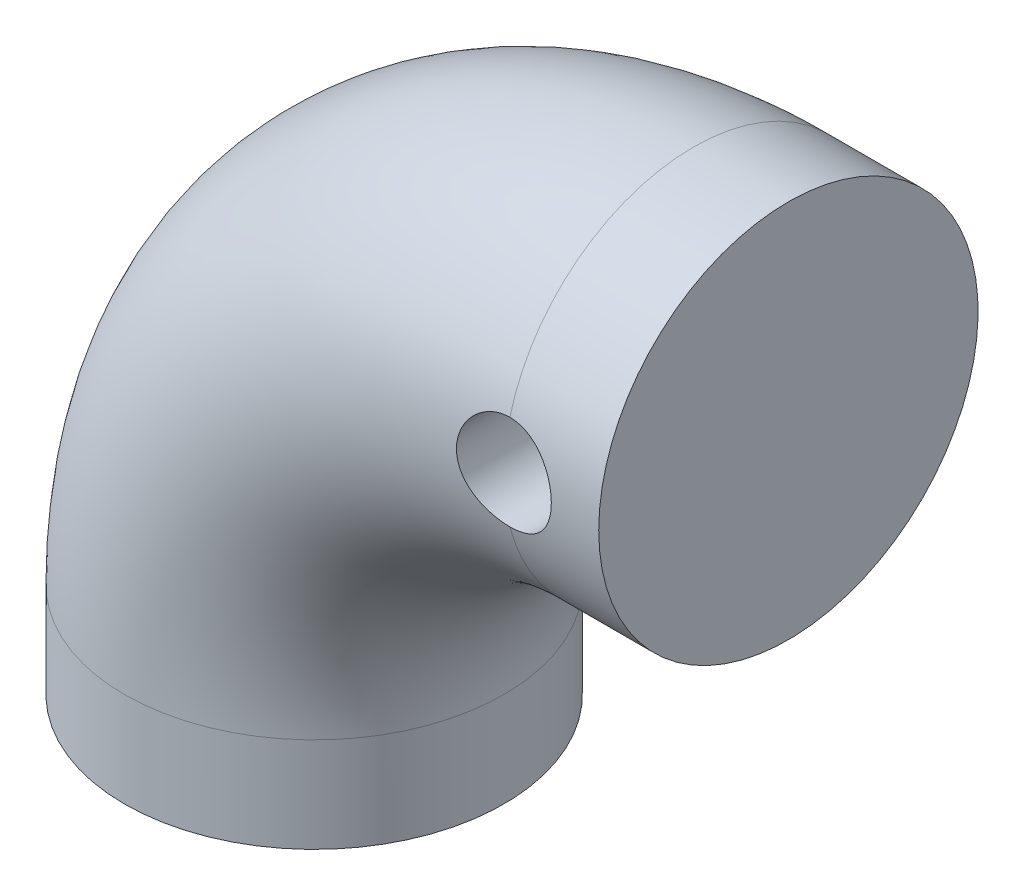
ISO-10303-21;
HEADER;
FILE_DESCRIPTION(('STEP AP214'),'2;1');
FILE_NAME('part.step','',(''),(''),'','','');
FILE_SCHEMA(('AUTOMOTIVE_DESIGN { 1 0 10303 214 1 1 1 1 }'));
ENDSEC;
DATA;
#1=APPLICATION_CONTEXT('core data for automotive mechanical design processes');
#2=APPLICATION_PROTOCOL_DEFINITION('international standard','automotive_design',2000,#1);
#3=PRODUCT_CONTEXT('',#1,'mechanical');
#4=PRODUCT('Part','Part','',(#3));
#5=PRODUCT_RELATED_PRODUCT_CATEGORY('part','',(#4));
#6=PRODUCT_DEFINITION_FORMATION('','',#4);
#7=PRODUCT_DEFINITION_CONTEXT('part definition',#1,'design');
#8=PRODUCT_DEFINITION('design','',#6,#7);
#9=PRODUCT_DEFINITION_SHAPE('','',#8);
#10=(LENGTH_UNIT() NAMED_UNIT(*) SI_UNIT(.MILLI.,.METRE.));
#11=(NAMED_UNIT(*) PLANE_ANGLE_UNIT() SI_UNIT($,.RADIAN.));
#12=(NAMED_UNIT(*) SI_UNIT($,.STERADIAN.) SOLID_ANGLE_UNIT());
#13=UNCERTAINTY_MEASURE_WITH_UNIT(LENGTH_MEASURE(1.E-05),#10,'distance_accuracy_value','');
#14=(GEOMETRIC_REPRESENTATION_CONTEXT(3) GLOBAL_UNCERTAINTY_ASSIGNED_CONTEXT((#13)) GLOBAL_UNIT_ASSIGNED_CONTEXT((#10,
#11,#12)) REPRESENTATION_CONTEXT('',''));
#15=CARTESIAN_POINT('',(0.,0.,0.));
#16=DIRECTION('',(0.,0.,1.));
#17=DIRECTION('',(1.,0.,0.));
#18=AXIS2_PLACEMENT_3D('',#15,#16,#17);
#19=CARTESIAN_POINT('',(-16.2646274369759,-3.10070951315685,0.));
#20=DIRECTION('',(0.,0.,-1.));
#21=DIRECTION('',(-1.,0.,0.));
#22=AXIS2_PLACEMENT_3D('',#19,#20,#21);
#23=TOROIDAL_SURFACE('',#22,16.,8.);
#24=CARTESIAN_POINT('',(-32.2646274369759,-3.10070951315696,0.));
#25=DIRECTION('',(0.,-1.,0.));
#26=DIRECTION('',(0.,0.,1.));
#27=AXIS2_PLACEMENT_3D('',#24,#25,#26);
#28=CIRCLE('',#27,8.);
#29=CARTESIAN_POINT('',(-32.2646274369759,-3.10070951315696,8.));
#30=VERTEX_POINT('',#29);
#31=EDGE_CURVE('E97',#30,#30,#28,.T.);
#32=ORIENTED_EDGE('',*,*,#31,.F.);
#33=EDGE_LOOP('',(#32));
#34=FACE_BOUND('',#33,.T.);
#35=CARTESIAN_POINT('',(-16.2644274369758,14.8992904768431,7.74596669470996));
#36=CARTESIAN_POINT('',(-16.3198963583289,14.8992964723466,7.74596279627583));
#37=CARTESIAN_POINT('',(-16.3753382984734,14.8969924919484,7.74649438566107));
#38=CARTESIAN_POINT('',(-16.4858127997248,14.8877953122605,7.74860003495758));
#39=CARTESIAN_POINT('',(-16.5408454152281,14.8809027341945,7.75017395375374));
#40=CARTESIAN_POINT('',(-16.7045367343919,14.8534345933593,7.75640593820359));
#41=CARTESIAN_POINT('',(-16.8120787800827,14.826068280207,7.76257451874861));
#42=CARTESIAN_POINT('',(-17.0208926696999,14.7540894931804,7.77832450177818));
#43=CARTESIAN_POINT('',(-17.1221641800592,14.7094761027439,7.78790608563796));
#44=CARTESIAN_POINT('',(-17.3158064810296,14.6043294786688,7.80953706738943));
#45=CARTESIAN_POINT('',(-17.4081759238434,14.5437938395163,7.82158683811086));
#46=CARTESIAN_POINT('',(-17.5829334771972,14.4074487383881,7.84718534474704));
#47=CARTESIAN_POINT('',(-17.6651474576771,14.3314199747597,7.86075417581855));
#48=CARTESIAN_POINT('',(-17.8157811081059,14.1667206699925,7.88789939611935));
#49=CARTESIAN_POINT('',(-17.8841980594522,14.0780476432596,7.90147578631069));
#50=CARTESIAN_POINT('',(-18.0062475158491,13.8890350230196,7.92745742215485));
#51=CARTESIAN_POINT('',(-18.0596528344673,13.7885457619202,7.93984297847902));
#52=CARTESIAN_POINT('',(-18.1487447938019,13.5797194457545,7.96187522549915));
#53=CARTESIAN_POINT('',(-18.1844339521441,13.4713835082805,7.97152230527379));
#54=CARTESIAN_POINT('',(-18.2365722074219,13.2514671064246,7.98684495090928));
#55=CARTESIAN_POINT('',(-18.2532772238909,13.1399510956969,7.9925729187712));
#56=CARTESIAN_POINT('',(-18.2677173302451,12.9155624123354,7.99951923763378));
#57=CARTESIAN_POINT('',(-18.2654554837306,12.8026899617399,8.00073831688153));
#58=CARTESIAN_POINT('',(-18.2423011018798,12.5817273410697,7.99841536806152));
#59=CARTESIAN_POINT('',(-18.2218657533927,12.4735877320668,7.99498909916222));
#60=CARTESIAN_POINT('',(-18.1636489347316,12.2623266684941,7.98381714042157));
#61=CARTESIAN_POINT('',(-18.1258677117286,12.1592051424421,7.9760715121288));
#62=CARTESIAN_POINT('',(-18.0341370484662,11.9607885489642,7.95699481035872));
#63=CARTESIAN_POINT('',(-17.9801861026823,11.8654942113623,7.94566340301255));
#64=CARTESIAN_POINT('',(-17.8576729982234,11.685168153712,7.92058297592865));
#65=CARTESIAN_POINT('',(-17.789108402013,11.6001381494499,7.90683355293649));
#66=CARTESIAN_POINT('',(-17.6370889835886,11.4402308646258,7.87801502546714));
#67=CARTESIAN_POINT('',(-17.5532738766024,11.365700639622,7.86291989376912));
#68=CARTESIAN_POINT('',(-17.3742515932088,11.2315840108773,7.83357733225181));
#69=CARTESIAN_POINT('',(-17.2790405084275,11.1720027558637,7.8193301957844));
#70=CARTESIAN_POINT('',(-17.0783970949371,11.0688050105066,7.79337134487405));
#71=CARTESIAN_POINT('',(-16.9728472387335,11.0254078115884,7.78169527750584));
#72=CARTESIAN_POINT('',(-16.7556159961858,10.9571674708855,7.76282386679749));
#73=CARTESIAN_POINT('',(-16.6439448567049,10.9322942808147,7.75562127008746));
#74=CARTESIAN_POINT('',(-16.4868166624185,10.9111678343956,7.74945955391702));
#75=CARTESIAN_POINT('',(-16.4424319377579,10.9067095538232,7.74815131197833));
#76=CARTESIAN_POINT('',(-16.3535143592249,10.9007718590859,7.74640441710349));
#77=CARTESIAN_POINT('',(-16.3089818324647,10.8992879335329,7.74596444722109));
#78=CARTESIAN_POINT('',(-16.2644274369758,10.8992904968431,7.74596669536566));
#79=B_SPLINE_CURVE_WITH_KNOTS('',3,(#35,#36,#37,#38,#39,#40,#41,#42,#43,#44,#45,#46,#47,#48,#49,
#50,#51,#52,#53,#54,#55,#56,#57,#58,#59,#60,#61,#62,#63,#64,#65,#66,#67,#68,#69,#70,#71,#72,#73,
#74,#75,#76,#77,#78),.UNSPECIFIED.,.F.,.F.,(4,2,2,2,2,2,2,2,2,2,2,2,2,2,2,2,2,2,2,2,2,4),(0.,
0.166302443747068,0.33258237734283,0.664283916643011,0.996003085993996,1.32777239988591,
1.66461241936267,2.00151874596241,2.34327860411946,2.68498988121184,3.02203787715162,
3.35903143286017,3.68777984335217,4.01652356947294,4.3452979136556,4.67412713988857,
5.01207781837567,5.35014473461499,5.69263894376778,6.03457636659706,6.16837189951974,
6.30196434245598),.UNSPECIFIED.);
#80=CARTESIAN_POINT('',(-16.2646274369758,14.8992904868431,7.74596669241486));
#81=VERTEX_POINT('',#80);
#82=CARTESIAN_POINT('',(-16.2646274369758,10.8992904868431,7.74596669241483));
#83=VERTEX_POINT('',#82);
#84=EDGE_CURVE('E66',#81,#83,#79,.T.);
#85=ORIENTED_EDGE('',*,*,#84,.F.);
#86=CARTESIAN_POINT('',(-16.2646274369758,12.8992904868431,0.));
#87=DIRECTION('',(-1.,0.,0.));
#88=DIRECTION('',(0.,0.,1.));
#89=AXIS2_PLACEMENT_3D('',#86,#87,#88);
#90=CIRCLE('',#89,8.);
#91=CARTESIAN_POINT('',(-16.2646274369758,14.8992904868431,-7.74596669241483));
#92=VERTEX_POINT('',#91);
#93=EDGE_CURVE('E91',#81,#92,#90,.T.);
#94=ORIENTED_EDGE('',*,*,#93,.T.);
#95=CARTESIAN_POINT('',(-16.2644274369758,10.8992904968431,-7.74596669536566));
#96=CARTESIAN_POINT('',(-16.319578113701,10.8992839703992,-7.74595953911321));
#97=CARTESIAN_POINT('',(-16.3747012733496,10.9015621065643,-7.74663752576368));
#98=CARTESIAN_POINT('',(-16.4845282614433,10.9106525113388,-7.74930946569253));
#99=CARTESIAN_POINT('',(-16.5392321801846,10.9174637741605,-7.75130312705468));
#100=CARTESIAN_POINT('',(-16.7018544286906,10.9445874319759,-7.75915968096074));
#101=CARTESIAN_POINT('',(-16.8086442787464,10.9715901964583,-7.76689882349837));
#102=CARTESIAN_POINT('',(-17.0159375902487,11.0425320361574,-7.78629756811106));
#103=CARTESIAN_POINT('',(-17.1164430871611,11.0864655942142,-7.79795589290235));
#104=CARTESIAN_POINT('',(-17.3087572654123,11.1899866565218,-7.82365486887605));
#105=CARTESIAN_POINT('',(-17.4005621704172,11.2495809160612,-7.83769654719705));
#106=CARTESIAN_POINT('',(-17.5754215220392,11.3845844525672,-7.86680973435804));
#107=CARTESIAN_POINT('',(-17.6581879191825,11.4603632008417,-7.88189849267698));
#108=CARTESIAN_POINT('',(-17.8100069239361,11.6248007651052,-7.91094747069053));
#109=CARTESIAN_POINT('',(-17.8790585029829,11.713460546264,-7.92490760569581));
#110=CARTESIAN_POINT('',(-18.002192891992,11.9024338201155,-7.95024625386565));
#111=CARTESIAN_POINT('',(-18.0560983817019,12.002867302591,-7.96159392501181));
#112=CARTESIAN_POINT('',(-18.1461698733257,12.2117399638384,-7.98024496419699));
#113=CARTESIAN_POINT('',(-18.1823398479333,12.3201773434981,-7.9875492379903));
#114=CARTESIAN_POINT('',(-18.2350088758717,12.5388636269934,-7.99725647481948));
#115=CARTESIAN_POINT('',(-18.2520078838229,12.6489866335872,-7.99978522953584));
#116=CARTESIAN_POINT('',(-18.2675005578892,12.8705307894986,-8.00018834987486));
#117=CARTESIAN_POINT('',(-18.2659954933725,12.9819518492467,-7.99806303477212));
#118=CARTESIAN_POINT('',(-18.2447467605998,13.2010265465754,-7.98959873496608));
#119=CARTESIAN_POINT('',(-18.2253003107813,13.308711986125,-7.98332888751962));
#120=CARTESIAN_POINT('',(-18.1692335794895,13.5192465307459,-7.9673932226797));
#121=CARTESIAN_POINT('',(-18.1326119975964,13.6220952689561,-7.95772714815388));
#122=CARTESIAN_POINT('',(-18.0425562568654,13.8218788928146,-7.93584769122555));
#123=CARTESIAN_POINT('',(-17.9888594097957,13.9186910206197,-7.92359558842866));
#124=CARTESIAN_POINT('',(-17.8663529569518,14.1020525836862,-7.89788947770747));
#125=CARTESIAN_POINT('',(-17.7975414578262,14.1886007311267,-7.8844353193319));
#126=CARTESIAN_POINT('',(-17.6448416459411,14.3510914172027,-7.85732574777589));
#127=CARTESIAN_POINT('',(-17.560638909244,14.4267392529026,-7.84367296713201));
#128=CARTESIAN_POINT('',(-17.3805180391109,14.5628804830593,-7.81785882118256));
#129=CARTESIAN_POINT('',(-17.2845971850002,14.6233703482024,-7.80569780354823));
#130=CARTESIAN_POINT('',(-17.0836618661955,14.7274020110749,-7.78410646907138));
#131=CARTESIAN_POINT('',(-16.9786453247286,14.7709399257135,-7.77467677800546));
#132=CARTESIAN_POINT('',(-16.7625785151962,14.8396131518873,-7.75954803951872));
#133=CARTESIAN_POINT('',(-16.6515369585623,14.8647743103659,-7.75384375350868));
#134=CARTESIAN_POINT('',(-16.493687502749,14.8866650309772,-7.74885792633735));
#135=CARTESIAN_POINT('',(-16.4479309436778,14.8914046199685,-7.74777409247876));
#136=CARTESIAN_POINT('',(-16.3562658778957,14.8977160349445,-7.74632835230053));
#137=CARTESIAN_POINT('',(-16.3103577564481,14.8992931781335,-7.74596523420998));
#138=CARTESIAN_POINT('',(-16.2644274369758,14.8992904768431,-7.74596669470996));
#139=B_SPLINE_CURVE_WITH_KNOTS('',3,(#95,#96,#97,#98,#99,#100,#101,#102,#103,#104,#105,#106,
#107,#108,#109,#110,#111,#112,#113,#114,#115,#116,#117,#118,#119,#120,#121,#122,#123,#124,#125,
#126,#127,#128,#129,#130,#131,#132,#133,#134,#135,#136,#137,#138),.UNSPECIFIED.,.F.,.F.,(4,2,2,
2,2,2,2,2,2,2,2,2,2,2,2,2,2,2,2,2,2,4),(0.,0.165346212522924,0.330655751070991,
0.660206030721513,0.989649012018963,1.31923433342112,1.65735174023975,1.99549449511807,
2.3374450858854,2.67931904587686,3.01205482892804,3.34476778663333,3.67206608644251,
3.99938917173385,4.33201353893958,4.66467959643961,5.00511054395508,5.3456206823887,
5.6862087738001,6.02631690000448,6.16426685014104,6.30198466185553),.UNSPECIFIED.);
#140=CARTESIAN_POINT('',(-16.2646274369758,10.8992904868431,-7.74596669241481));
#141=VERTEX_POINT('',#140);
#142=EDGE_CURVE('E72',#141,#92,#139,.T.);
#143=ORIENTED_EDGE('',*,*,#142,.F.);
#144=EDGE_CURVE('E92',#141,#83,#90,.T.);
#145=ORIENTED_EDGE('',*,*,#144,.T.);
#146=EDGE_LOOP('',(#85,#94,#143,#145));
#147=FACE_BOUND('',#146,.T.);
#148=ADVANCED_FACE('F47',(#34,#147),#23,.T.);
#149=CARTESIAN_POINT('',(-16.2646274369758,12.8992904868432,0.));
#150=DIRECTION('',(1.,0.,0.));
#151=DIRECTION('',(0.,0.,-1.));
#152=AXIS2_PLACEMENT_3D('',#149,#150,#151);
#153=CYLINDRICAL_SURFACE('',#152,8.);
#154=CARTESIAN_POINT('',(-12.2646274369759,12.8992904868432,0.));
#155=DIRECTION('',(-1.,0.,0.));
#156=DIRECTION('',(0.,0.,1.));
#157=AXIS2_PLACEMENT_3D('',#154,#155,#156);
#158=CIRCLE('',#157,8.);
#159=CARTESIAN_POINT('',(-12.2646274369759,12.8992904868432,8.));
#160=VERTEX_POINT('',#159);
#161=EDGE_CURVE('E88',#160,#160,#158,.T.);
#162=ORIENTED_EDGE('',*,*,#161,.T.);
#163=EDGE_LOOP('',(#162));
#164=FACE_BOUND('',#163,.T.);
#165=CARTESIAN_POINT('',(-16.2646274369758,14.8992904868431,-7.74596669241486));
#166=CARTESIAN_POINT('',(-16.2093014667628,14.8992911618353,-7.74596297160357));
#167=CARTESIAN_POINT('',(-16.1540029109394,14.8969933015938,-7.74656019898944));
#168=CARTESIAN_POINT('',(-16.0438193663687,14.8878330776346,-7.7489180954912));
#169=CARTESIAN_POINT('',(-15.9889343096017,14.8809714819884,-7.75067856883376));
#170=CARTESIAN_POINT('',(-15.8257210905581,14.8536409656081,-7.7576342194411));
#171=CARTESIAN_POINT('',(-15.7185145000114,14.8264258771881,-7.7645040629762));
#172=CARTESIAN_POINT('',(-15.5103780894119,14.7548866393391,-7.78190845176008));
#173=CARTESIAN_POINT('',(-15.4094476805501,14.7105640976907,-7.79244265261862));
#174=CARTESIAN_POINT('',(-15.2164045396812,14.6061212428948,-7.8159826894388));
#175=CARTESIAN_POINT('',(-15.1242941811939,14.5459966935569,-7.82898918791296));
#176=CARTESIAN_POINT('',(-14.9495396731636,14.4102594304992,-7.85632524796052));
#177=CARTESIAN_POINT('',(-14.8671176644848,14.334365024411,-7.87067582057833));
#178=CARTESIAN_POINT('',(-14.7160232580104,14.1698420478755,-7.89890208792388));
#179=CARTESIAN_POINT('',(-14.64735305804,14.0812114458007,-7.91277770645076));
#180=CARTESIAN_POINT('',(-14.5248054337385,13.8922042856464,-7.93872364566498));
#181=CARTESIAN_POINT('',(-14.4711476450079,13.791681167512,-7.95076609363462));
#182=CARTESIAN_POINT('',(-14.3815779685824,13.5826956685289,-7.97144692501178));
#183=CARTESIAN_POINT('',(-14.3456625883762,13.4742348550091,-7.98008597829402));
#184=CARTESIAN_POINT('',(-14.293309451421,13.2547787038934,-7.99283800010257));
#185=CARTESIAN_POINT('',(-14.2764920921302,13.1438791308488,-7.99703905802602));
#186=CARTESIAN_POINT('',(-14.2616206938893,12.9207560382064,-8.00074876301631));
#187=CARTESIAN_POINT('',(-14.2635642965912,12.8085326867857,-8.00025799986889));
#188=CARTESIAN_POINT('',(-14.2858873643467,12.5885855008989,-7.99470474731471));
#189=CARTESIAN_POINT('',(-14.3058566701748,12.4808170833634,-7.98974397354721));
#190=CARTESIAN_POINT('',(-14.3630047953413,12.2702130646744,-7.97592661272991));
#191=CARTESIAN_POINT('',(-14.400184376113,12.1673776819951,-7.96706985331111));
#192=CARTESIAN_POINT('',(-14.4910299983171,11.968475914794,-7.94629995523596));
#193=CARTESIAN_POINT('',(-14.5448422254415,11.8724792276386,-7.9343598765511));
#194=CARTESIAN_POINT('',(-14.6673136966428,11.690737224383,-7.90871891083837));
#195=CARTESIAN_POINT('',(-14.7359751774823,11.6049934557185,-7.89501775866395));
#196=CARTESIAN_POINT('',(-14.8883852611385,11.4437517074261,-7.86691132045729));
#197=CARTESIAN_POINT('',(-14.9724907100555,11.3685922807348,-7.85249700955369));
#198=CARTESIAN_POINT('',(-15.1522871708313,11.2333513364706,-7.82492336568011));
#199=CARTESIAN_POINT('',(-15.247981343543,11.1732739463529,-7.81176437685985));
#200=CARTESIAN_POINT('',(-15.4489186326234,11.0696810682711,-7.78815627172649));
#201=CARTESIAN_POINT('',(-15.554210366768,11.0262564510685,-7.77772212018272));
#202=CARTESIAN_POINT('',(-15.7708612938124,10.9578857831434,-7.76094117614108));
#203=CARTESIAN_POINT('',(-15.8822111472755,10.9329121084188,-7.75458827522869));
#204=CARTESIAN_POINT('',(-16.0395421984936,10.9114812165412,-7.74910581363046));
#205=CARTESIAN_POINT('',(-16.0844668434022,10.9069089049097,-7.74793046221717));
#206=CARTESIAN_POINT('',(-16.1744630167945,10.9008169714483,-7.74636124977947));
#207=CARTESIAN_POINT('',(-16.2195341888864,10.899292410651,-7.7459661243892));
#208=CARTESIAN_POINT('',(-16.2646274369758,10.8992904868431,-7.74596669241481));
#209=B_SPLINE_CURVE_WITH_KNOTS('',3,(#165,#166,#167,#168,#169,#170,#171,#172,#173,#174,#175,
#176,#177,#178,#179,#180,#181,#182,#183,#184,#185,#186,#187,#188,#189,#190,#191,#192,#193,#194,
#195,#196,#197,#198,#199,#200,#201,#202,#203,#204,#205,#206,#207,#208),.UNSPECIFIED.,.F.,.F.,(4,
2,2,2,2,2,2,2,2,2,2,2,2,2,2,2,2,2,2,2,2,4),(0.,0.165873060679539,0.331718212169303,
0.662459926160636,0.993170564182996,1.3239699494535,1.66128379485595,1.99865150707839,
2.3407237419647,2.68272861464849,3.0178096303065,3.35284852513277,3.68045090958551,
4.00806778951676,4.33865018900753,4.66928241928658,5.00882859069084,5.34846758361934,
5.68993440322135,6.03088895079971,6.16631697445295,6.30152535463342),.UNSPECIFIED.);
#210=EDGE_CURVE('E12',#92,#141,#209,.T.);
#211=ORIENTED_EDGE('',*,*,#210,.F.);
#212=ORIENTED_EDGE('',*,*,#93,.F.);
#213=CARTESIAN_POINT('',(-16.2646274369758,10.8992904868431,7.74596669241481));
#214=CARTESIAN_POINT('',(-16.2093014667628,10.8992898118508,7.74596297160352));
#215=CARTESIAN_POINT('',(-16.1540029109394,10.9015876720923,7.74656019898939));
#216=CARTESIAN_POINT('',(-16.0438193663687,10.9107478960516,7.74891809549116));
#217=CARTESIAN_POINT('',(-15.9889343096017,10.9176094916977,7.75067856883372));
#218=CARTESIAN_POINT('',(-15.8257210905581,10.944940008078,7.75763421944105));
#219=CARTESIAN_POINT('',(-15.7185145000114,10.9721550964981,7.76450406297616));
#220=CARTESIAN_POINT('',(-15.5103780894119,11.0436943343471,7.78190845176004));
#221=CARTESIAN_POINT('',(-15.4094476805501,11.0880168759954,7.79244265261858));
#222=CARTESIAN_POINT('',(-15.2164045396812,11.1924597307913,7.81598268943877));
#223=CARTESIAN_POINT('',(-15.1242941811939,11.2525842801292,7.82898918791292));
#224=CARTESIAN_POINT('',(-14.9495396731636,11.3883215431869,7.85632524796049));
#225=CARTESIAN_POINT('',(-14.8671176644848,11.4642159492751,7.8706758205783));
#226=CARTESIAN_POINT('',(-14.7160232580104,11.6287389258106,7.89890208792386));
#227=CARTESIAN_POINT('',(-14.64735305804,11.7173695278854,7.91277770645073));
#228=CARTESIAN_POINT('',(-14.5248054337385,11.9063766880397,7.93872364566495));
#229=CARTESIAN_POINT('',(-14.4711476450079,12.0068998061741,7.9507660936346));
#230=CARTESIAN_POINT('',(-14.3815779685824,12.2158853051572,7.97144692501177));
#231=CARTESIAN_POINT('',(-14.3456625883762,12.324346118677,7.98008597829401));
#232=CARTESIAN_POINT('',(-14.293309451421,12.5438022697927,7.99283800010256));
#233=CARTESIAN_POINT('',(-14.2764920921302,12.6547018428374,7.99703905802601));
#234=CARTESIAN_POINT('',(-14.2616206938893,12.8778249354797,8.00074876301631));
#235=CARTESIAN_POINT('',(-14.2635642965912,12.9900482869005,8.00025799986889));
#236=CARTESIAN_POINT('',(-14.2858873643467,13.2099954727873,7.99470474731472));
#237=CARTESIAN_POINT('',(-14.3058566701748,13.3177638903228,7.98974397354722));
#238=CARTESIAN_POINT('',(-14.3630047953413,13.5283679090117,7.97592661272993));
#239=CARTESIAN_POINT('',(-14.400184376113,13.631203291691,7.96706985331113));
#240=CARTESIAN_POINT('',(-14.4910299983171,13.8301050588921,7.94629995523598));
#241=CARTESIAN_POINT('',(-14.5448422254415,13.9261017460476,7.93435987655112));
#242=CARTESIAN_POINT('',(-14.6673136966428,14.1078437493031,7.9087189108384));
#243=CARTESIAN_POINT('',(-14.7359751774823,14.1935875179676,7.89501775866398));
#244=CARTESIAN_POINT('',(-14.8883852611385,14.35482926626,7.86691132045733));
#245=CARTESIAN_POINT('',(-14.9724907100555,14.4299886929513,7.85249700955373));
#246=CARTESIAN_POINT('',(-15.1522871708313,14.5652296372155,7.82492336568014));
#247=CARTESIAN_POINT('',(-15.247981343543,14.6253070273332,7.81176437685989));
#248=CARTESIAN_POINT('',(-15.4489186326234,14.728899905415,7.78815627172653));
#249=CARTESIAN_POINT('',(-15.554210366768,14.7723245226176,7.77772212018276));
#250=CARTESIAN_POINT('',(-15.7708612938124,14.8406951905427,7.76094117614112));
#251=CARTESIAN_POINT('',(-15.8822111472755,14.8656688652673,7.75458827522873));
#252=CARTESIAN_POINT('',(-16.0395421984936,14.8870997571449,7.74910581363051));
#253=CARTESIAN_POINT('',(-16.0844668434022,14.8916720687765,7.74793046221721));
#254=CARTESIAN_POINT('',(-16.1744630167945,14.8977640022379,7.74636124977951));
#255=CARTESIAN_POINT('',(-16.2195341888864,14.8992885630352,7.74596612438924));
#256=CARTESIAN_POINT('',(-16.2646274369758,14.8992904868431,7.74596669241486));
#257=B_SPLINE_CURVE_WITH_KNOTS('',3,(#213,#214,#215,#216,#217,#218,#219,#220,#221,#222,#223,
#224,#225,#226,#227,#228,#229,#230,#231,#232,#233,#234,#235,#236,#237,#238,#239,#240,#241,#242,
#243,#244,#245,#246,#247,#248,#249,#250,#251,#252,#253,#254,#255,#256),.UNSPECIFIED.,.F.,.F.,(4,
2,2,2,2,2,2,2,2,2,2,2,2,2,2,2,2,2,2,2,2,4),(0.,0.165873060679542,0.331718212169306,
0.662459926160634,0.993170564182999,1.3239699494535,1.66128379485595,1.99865150707838,
2.34072374196469,2.68272861464849,3.01780963030649,3.35284852513278,3.68045090958551,
4.00806778951676,4.33865018900753,4.66928241928657,5.00882859069084,5.34846758361934,
5.68993440322134,6.03088895079971,6.16631697445294,6.30152535463342),.UNSPECIFIED.);
#258=EDGE_CURVE('E60',#83,#81,#257,.T.);
#259=ORIENTED_EDGE('',*,*,#258,.F.);
#260=ORIENTED_EDGE('',*,*,#144,.F.);
#261=EDGE_LOOP('',(#211,#212,#259,#260));
#262=FACE_BOUND('',#261,.T.);
#263=ADVANCED_FACE('F94',(#164,#262),#153,.T.);
#264=CARTESIAN_POINT('',(-32.2646274369759,-7.10070951315685,0.));
#265=DIRECTION('',(0.,-1.,0.));
#266=DIRECTION('',(0.,0.,1.));
#267=AXIS2_PLACEMENT_3D('',#264,#265,#266);
#268=PLANE('',#267);
#269=CARTESIAN_POINT('',(-32.2646274369759,-7.10070951315685,0.));
#270=DIRECTION('',(0.,-1.,0.));
#271=DIRECTION('',(0.,0.,1.));
#272=AXIS2_PLACEMENT_3D('',#269,#270,#271);
#273=CIRCLE('',#272,8.);
#274=CARTESIAN_POINT('',(-32.2646274369759,-7.10070951315685,8.));
#275=VERTEX_POINT('',#274);
#276=EDGE_CURVE('E130',#275,#275,#273,.T.);
#277=ORIENTED_EDGE('',*,*,#276,.T.);
#278=EDGE_LOOP('',(#277));
#279=FACE_BOUND('',#278,.T.);
#280=ADVANCED_FACE('F49',(#279),#268,.T.);
#281=CARTESIAN_POINT('',(-12.2646274369759,12.8992904868432,0.));
#282=DIRECTION('',(-1.,0.,0.));
#283=DIRECTION('',(0.,0.,1.));
#284=AXIS2_PLACEMENT_3D('',#281,#282,#283);
#285=PLANE('',#284);
#286=ORIENTED_EDGE('',*,*,#161,.F.);
#287=EDGE_LOOP('',(#286));
#288=FACE_BOUND('',#287,.T.);
#289=ADVANCED_FACE('F135',(#288),#285,.F.);
#290=CARTESIAN_POINT('',(-32.2646274369759,-7.10070951315685,0.));
#291=DIRECTION('',(0.,1.,0.));
#292=DIRECTION('',(0.,0.,1.));
#293=AXIS2_PLACEMENT_3D('',#290,#291,#292);
#294=CYLINDRICAL_SURFACE('',#293,8.);
#295=ORIENTED_EDGE('',*,*,#31,.T.);
#296=EDGE_LOOP('',(#295));
#297=FACE_BOUND('',#296,.T.);
#298=ORIENTED_EDGE('',*,*,#276,.F.);
#299=EDGE_LOOP('',(#298));
#300=FACE_BOUND('',#299,.T.);
#301=ADVANCED_FACE('F108',(#297,#300),#294,.T.);
#302=CARTESIAN_POINT('',(-16.2646274369758,12.8992904868431,10.));
#303=DIRECTION('',(0.,0.,-1.));
#304=DIRECTION('',(-1.,0.,0.));
#305=AXIS2_PLACEMENT_3D('',#302,#303,#304);
#306=CYLINDRICAL_SURFACE('',#305,2.);
#307=ORIENTED_EDGE('',*,*,#84,.T.);
#308=ORIENTED_EDGE('',*,*,#258,.T.);
#309=EDGE_LOOP('',(#307,#308));
#310=FACE_BOUND('',#309,.T.);
#311=ORIENTED_EDGE('',*,*,#142,.T.);
#312=ORIENTED_EDGE('',*,*,#210,.T.);
#313=EDGE_LOOP('',(#311,#312));
#314=FACE_BOUND('',#313,.T.);
#315=ADVANCED_FACE('F83',(#310,#314),#306,.F.);
#316=CLOSED_SHELL('',(#148,#263,#280,#289,#301,#315));
#317=MANIFOLD_SOLID_BREP('B2',#316);
#318=ADVANCED_BREP_SHAPE_REPRESENTATION('',(#18,#317),#14);
#319=SHAPE_DEFINITION_REPRESENTATION(#9,#318);
ENDSEC;
END-ISO-10303-21;
